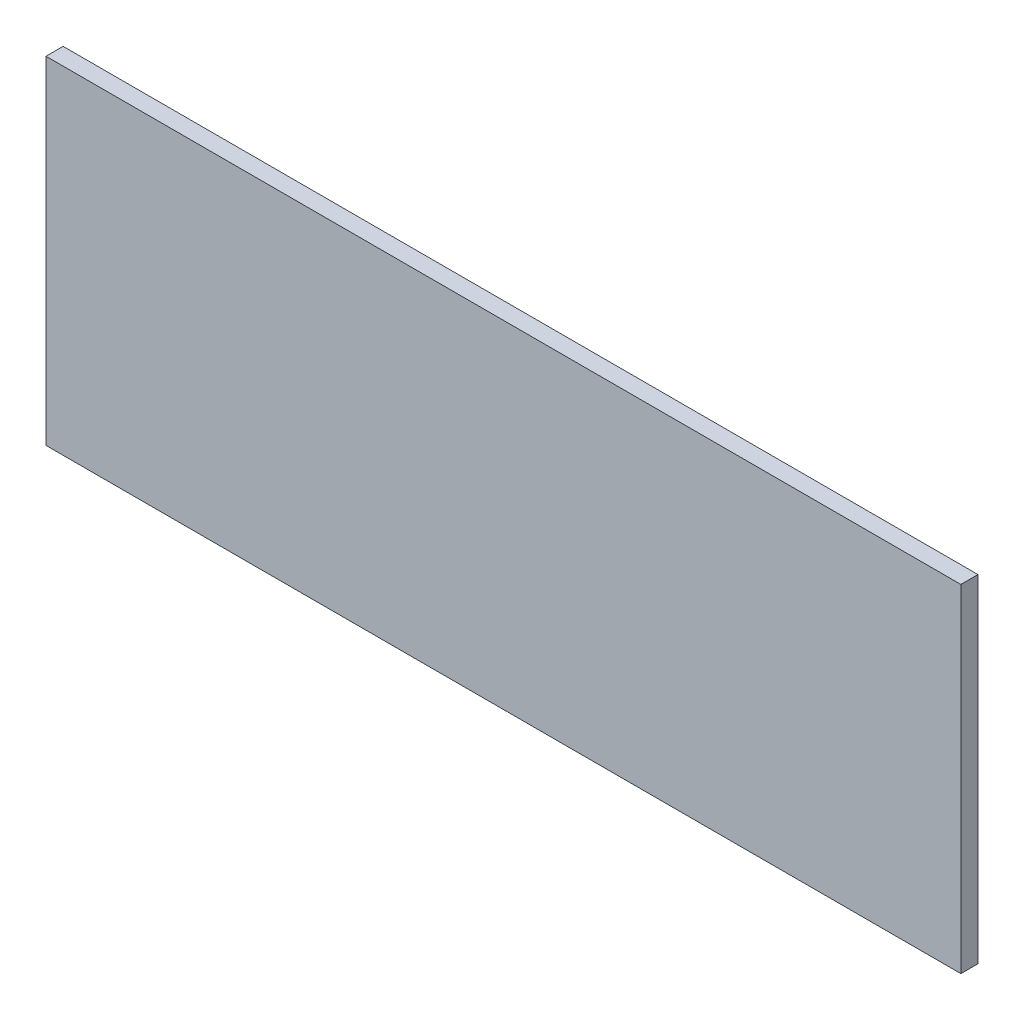
ISO-10303-21;
HEADER;
FILE_DESCRIPTION(('STEP AP214'),'2;1');
FILE_NAME('part.step','',(''),(''),'','','');
FILE_SCHEMA(('AUTOMOTIVE_DESIGN { 1 0 10303 214 1 1 1 1 }'));
ENDSEC;
DATA;
#1=APPLICATION_CONTEXT('core data for automotive mechanical design processes');
#2=APPLICATION_PROTOCOL_DEFINITION('international standard','automotive_design',2000,#1);
#3=PRODUCT_CONTEXT('',#1,'mechanical');
#4=PRODUCT('Part','Part','',(#3));
#5=PRODUCT_RELATED_PRODUCT_CATEGORY('part','',(#4));
#6=PRODUCT_DEFINITION_FORMATION('','',#4);
#7=PRODUCT_DEFINITION_CONTEXT('part definition',#1,'design');
#8=PRODUCT_DEFINITION('design','',#6,#7);
#9=PRODUCT_DEFINITION_SHAPE('','',#8);
#10=(LENGTH_UNIT() NAMED_UNIT(*) SI_UNIT(.MILLI.,.METRE.));
#11=(NAMED_UNIT(*) PLANE_ANGLE_UNIT() SI_UNIT($,.RADIAN.));
#12=(NAMED_UNIT(*) SI_UNIT($,.STERADIAN.) SOLID_ANGLE_UNIT());
#13=UNCERTAINTY_MEASURE_WITH_UNIT(LENGTH_MEASURE(1.E-05),#10,'distance_accuracy_value','');
#14=(GEOMETRIC_REPRESENTATION_CONTEXT(3) GLOBAL_UNCERTAINTY_ASSIGNED_CONTEXT((#13)) GLOBAL_UNIT_ASSIGNED_CONTEXT((#10,
#11,#12)) REPRESENTATION_CONTEXT('',''));
#15=CARTESIAN_POINT('',(0.,0.,0.));
#16=DIRECTION('',(0.,0.,1.));
#17=DIRECTION('',(1.,0.,0.));
#18=AXIS2_PLACEMENT_3D('',#15,#16,#17);
#19=CARTESIAN_POINT('',(96.5670013427734,57.5870018005371,0.));
#20=DIRECTION('',(0.,1.,0.));
#21=DIRECTION('',(1.,0.,0.));
#22=AXIS2_PLACEMENT_3D('',#19,#20,#21);
#23=PLANE('',#22);
#24=DIRECTION('',(1.,0.,0.));
#25=VECTOR('',#24,1.);
#26=CARTESIAN_POINT('',(96.5670013427734,57.5870018005371,0.03556));
#27=LINE('',#26,#25);
#28=CARTESIAN_POINT('',(96.5670013427734,57.5870018005371,0.03556));
#29=VERTEX_POINT('',#28);
#30=CARTESIAN_POINT('',(98.4670028686523,57.5870018005371,0.03556));
#31=VERTEX_POINT('',#30);
#32=EDGE_CURVE('E11',#29,#31,#27,.T.);
#33=ORIENTED_EDGE('',*,*,#32,.F.);
#34=DIRECTION('',(0.,0.,1.));
#35=VECTOR('',#34,1.);
#36=CARTESIAN_POINT('',(96.5670013427734,57.5870018005371,0.));
#37=LINE('',#36,#35);
#38=CARTESIAN_POINT('',(96.5670013427734,57.5870018005371,0.));
#39=VERTEX_POINT('',#38);
#40=EDGE_CURVE('E24',#39,#29,#37,.T.);
#41=ORIENTED_EDGE('',*,*,#40,.F.);
#42=DIRECTION('',(1.,0.,0.));
#43=VECTOR('',#42,1.);
#44=CARTESIAN_POINT('',(96.5670013427734,57.5870018005371,0.));
#45=LINE('',#44,#43);
#46=CARTESIAN_POINT('',(98.4670028686523,57.5870018005371,0.));
#47=VERTEX_POINT('',#46);
#48=EDGE_CURVE('E75',#39,#47,#45,.T.);
#49=ORIENTED_EDGE('',*,*,#48,.T.);
#50=DIRECTION('',(0.,0.,1.));
#51=VECTOR('',#50,1.);
#52=CARTESIAN_POINT('',(98.4670028686523,57.5870018005371,0.));
#53=LINE('',#52,#51);
#54=EDGE_CURVE('E37',#47,#31,#53,.T.);
#55=ORIENTED_EDGE('',*,*,#54,.T.);
#56=EDGE_LOOP('',(#33,#41,#49,#55));
#57=FACE_BOUND('',#56,.T.);
#58=ADVANCED_FACE('F17',(#57),#23,.F.);
#59=CARTESIAN_POINT('',(98.4670028686523,57.5870018005371,0.));
#60=DIRECTION('',(-1.,0.,0.));
#61=DIRECTION('',(0.,1.,0.));
#62=AXIS2_PLACEMENT_3D('',#59,#60,#61);
#63=PLANE('',#62);
#64=DIRECTION('',(0.,1.,0.));
#65=VECTOR('',#64,1.);
#66=CARTESIAN_POINT('',(98.4670028686523,57.5870018005371,0.03556));
#67=LINE('',#66,#65);
#68=CARTESIAN_POINT('',(98.4670028686523,58.2869987487793,0.03556));
#69=VERTEX_POINT('',#68);
#70=EDGE_CURVE('E83',#31,#69,#67,.T.);
#71=ORIENTED_EDGE('',*,*,#70,.F.);
#72=ORIENTED_EDGE('',*,*,#54,.F.);
#73=DIRECTION('',(0.,1.,0.));
#74=VECTOR('',#73,1.);
#75=CARTESIAN_POINT('',(98.4670028686523,57.5870018005371,0.));
#76=LINE('',#75,#74);
#77=CARTESIAN_POINT('',(98.4670028686523,58.2869987487793,0.));
#78=VERTEX_POINT('',#77);
#79=EDGE_CURVE('E81',#47,#78,#76,.T.);
#80=ORIENTED_EDGE('',*,*,#79,.T.);
#81=DIRECTION('',(0.,0.,1.));
#82=VECTOR('',#81,1.);
#83=CARTESIAN_POINT('',(98.4670028686523,58.2869987487793,0.));
#84=LINE('',#83,#82);
#85=EDGE_CURVE('E67',#78,#69,#84,.T.);
#86=ORIENTED_EDGE('',*,*,#85,.T.);
#87=EDGE_LOOP('',(#71,#72,#80,#86));
#88=FACE_BOUND('',#87,.T.);
#89=ADVANCED_FACE('F89',(#88),#63,.F.);
#90=CARTESIAN_POINT('',(98.4670028686523,58.2869987487793,0.));
#91=DIRECTION('',(0.,-1.,0.));
#92=DIRECTION('',(-1.,0.,0.));
#93=AXIS2_PLACEMENT_3D('',#90,#91,#92);
#94=PLANE('',#93);
#95=DIRECTION('',(-1.,0.,0.));
#96=VECTOR('',#95,1.);
#97=CARTESIAN_POINT('',(98.4670028686523,58.2869987487793,0.03556));
#98=LINE('',#97,#96);
#99=CARTESIAN_POINT('',(96.5670013427734,58.2869987487793,0.03556));
#100=VERTEX_POINT('',#99);
#101=EDGE_CURVE('E71',#69,#100,#98,.T.);
#102=ORIENTED_EDGE('',*,*,#101,.F.);
#103=ORIENTED_EDGE('',*,*,#85,.F.);
#104=DIRECTION('',(-1.,0.,0.));
#105=VECTOR('',#104,1.);
#106=CARTESIAN_POINT('',(98.4670028686523,58.2869987487793,0.));
#107=LINE('',#106,#105);
#108=CARTESIAN_POINT('',(96.5670013427734,58.2869987487793,0.));
#109=VERTEX_POINT('',#108);
#110=EDGE_CURVE('E63',#78,#109,#107,.T.);
#111=ORIENTED_EDGE('',*,*,#110,.T.);
#112=DIRECTION('',(0.,0.,1.));
#113=VECTOR('',#112,1.);
#114=CARTESIAN_POINT('',(96.5670013427734,58.2869987487793,0.));
#115=LINE('',#114,#113);
#116=EDGE_CURVE('E53',#109,#100,#115,.T.);
#117=ORIENTED_EDGE('',*,*,#116,.T.);
#118=EDGE_LOOP('',(#102,#103,#111,#117));
#119=FACE_BOUND('',#118,.T.);
#120=ADVANCED_FACE('F66',(#119),#94,.F.);
#121=CARTESIAN_POINT('',(96.5670013427734,58.2869987487793,0.));
#122=DIRECTION('',(1.,0.,0.));
#123=DIRECTION('',(0.,-1.,0.));
#124=AXIS2_PLACEMENT_3D('',#121,#122,#123);
#125=PLANE('',#124);
#126=DIRECTION('',(0.,-1.,0.));
#127=VECTOR('',#126,1.);
#128=CARTESIAN_POINT('',(96.5670013427734,58.2869987487793,0.03556));
#129=LINE('',#128,#127);
#130=EDGE_CURVE('E59',#100,#29,#129,.T.);
#131=ORIENTED_EDGE('',*,*,#130,.F.);
#132=ORIENTED_EDGE('',*,*,#116,.F.);
#133=DIRECTION('',(0.,-1.,0.));
#134=VECTOR('',#133,1.);
#135=CARTESIAN_POINT('',(96.5670013427734,58.2869987487793,0.));
#136=LINE('',#135,#134);
#137=EDGE_CURVE('E57',#109,#39,#136,.T.);
#138=ORIENTED_EDGE('',*,*,#137,.T.);
#139=ORIENTED_EDGE('',*,*,#40,.T.);
#140=EDGE_LOOP('',(#131,#132,#138,#139));
#141=FACE_BOUND('',#140,.T.);
#142=ADVANCED_FACE('F55',(#141),#125,.F.);
#143=CARTESIAN_POINT('',(96.5670013427734,57.5870018005371,0.));
#144=DIRECTION('',(0.,0.,-1.));
#145=DIRECTION('',(-1.,0.,0.));
#146=AXIS2_PLACEMENT_3D('',#143,#144,#145);
#147=PLANE('',#146);
#148=ORIENTED_EDGE('',*,*,#137,.F.);
#149=ORIENTED_EDGE('',*,*,#110,.F.);
#150=ORIENTED_EDGE('',*,*,#79,.F.);
#151=ORIENTED_EDGE('',*,*,#48,.F.);
#152=EDGE_LOOP('',(#148,#149,#150,#151));
#153=FACE_BOUND('',#152,.T.);
#154=ADVANCED_FACE('F74',(#153),#147,.T.);
#155=CARTESIAN_POINT('',(96.5670013427734,57.5870018005371,0.03556));
#156=DIRECTION('',(0.,0.,-1.));
#157=DIRECTION('',(-1.,0.,0.));
#158=AXIS2_PLACEMENT_3D('',#155,#156,#157);
#159=PLANE('',#158);
#160=ORIENTED_EDGE('',*,*,#32,.T.);
#161=ORIENTED_EDGE('',*,*,#70,.T.);
#162=ORIENTED_EDGE('',*,*,#101,.T.);
#163=ORIENTED_EDGE('',*,*,#130,.T.);
#164=EDGE_LOOP('',(#160,#161,#162,#163));
#165=FACE_BOUND('',#164,.T.);
#166=ADVANCED_FACE('F91',(#165),#159,.F.);
#167=CLOSED_SHELL('',(#58,#89,#120,#142,#154,#166));
#168=MANIFOLD_SOLID_BREP('B1',#167);
#169=ADVANCED_BREP_SHAPE_REPRESENTATION('',(#18,#168),#14);
#170=SHAPE_DEFINITION_REPRESENTATION(#9,#169);
ENDSEC;
END-ISO-10303-21;
